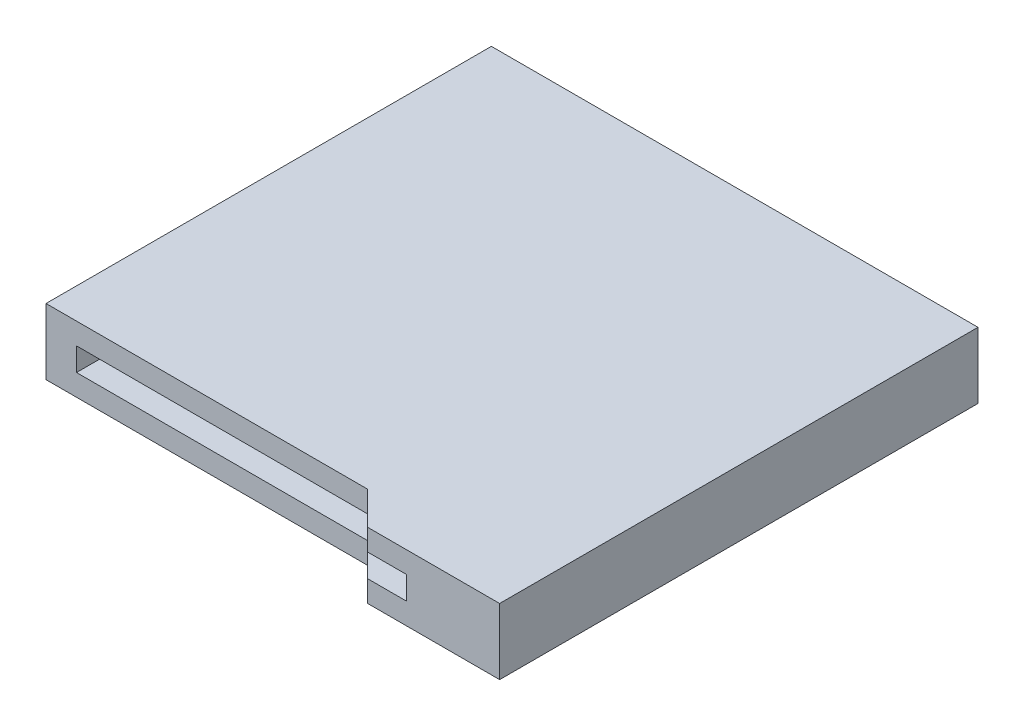
ISO-10303-21;
HEADER;
FILE_DESCRIPTION(('STEP AP214'),'2;1');
FILE_NAME('part.step','',(''),(''),'','','');
FILE_SCHEMA(('AUTOMOTIVE_DESIGN { 1 0 10303 214 1 1 1 1 }'));
ENDSEC;
DATA;
#1=APPLICATION_CONTEXT('core data for automotive mechanical design processes');
#2=APPLICATION_PROTOCOL_DEFINITION('international standard','automotive_design',2000,#1);
#3=PRODUCT_CONTEXT('',#1,'mechanical');
#4=PRODUCT('Part','Part','',(#3));
#5=PRODUCT_RELATED_PRODUCT_CATEGORY('part','',(#4));
#6=PRODUCT_DEFINITION_FORMATION('','',#4);
#7=PRODUCT_DEFINITION_CONTEXT('part definition',#1,'design');
#8=PRODUCT_DEFINITION('design','',#6,#7);
#9=PRODUCT_DEFINITION_SHAPE('','',#8);
#10=(LENGTH_UNIT() NAMED_UNIT(*) SI_UNIT(.MILLI.,.METRE.));
#11=(NAMED_UNIT(*) PLANE_ANGLE_UNIT() SI_UNIT($,.RADIAN.));
#12=(NAMED_UNIT(*) SI_UNIT($,.STERADIAN.) SOLID_ANGLE_UNIT());
#13=UNCERTAINTY_MEASURE_WITH_UNIT(LENGTH_MEASURE(1.E-05),#10,'distance_accuracy_value','');
#14=(GEOMETRIC_REPRESENTATION_CONTEXT(3) GLOBAL_UNCERTAINTY_ASSIGNED_CONTEXT((#13)) GLOBAL_UNIT_ASSIGNED_CONTEXT((#10,
#11,#12)) REPRESENTATION_CONTEXT('',''));
#15=CARTESIAN_POINT('',(0.,0.,0.));
#16=DIRECTION('',(0.,0.,1.));
#17=DIRECTION('',(1.,0.,0.));
#18=AXIS2_PLACEMENT_3D('',#15,#16,#17);
#19=CARTESIAN_POINT('',(2.37499999999999,0.,6.25));
#20=DIRECTION('',(0.707106781186544,0.,-0.707106781186552));
#21=DIRECTION('',(-0.707106781186552,0.,-0.707106781186544));
#22=AXIS2_PLACEMENT_3D('',#19,#20,#21);
#23=PLANE('',#22);
#24=DIRECTION('',(0.,1.,0.));
#25=VECTOR('',#24,1.);
#26=CARTESIAN_POINT('',(3.375,0.,7.25));
#27=LINE('',#26,#25);
#28=CARTESIAN_POINT('',(3.375,0.,7.25));
#29=VERTEX_POINT('',#28);
#30=CARTESIAN_POINT('',(3.375,0.65,7.25));
#31=VERTEX_POINT('',#30);
#32=EDGE_CURVE('E186',#29,#31,#27,.T.);
#33=ORIENTED_EDGE('',*,*,#32,.T.);
#34=DIRECTION('',(-0.707106781186552,0.,-0.707106781186544));
#35=VECTOR('',#34,1.);
#36=CARTESIAN_POINT('',(2.37499999999999,0.65,6.25));
#37=LINE('',#36,#35);
#38=CARTESIAN_POINT('',(2.37499999999999,0.65,6.25));
#39=VERTEX_POINT('',#38);
#40=EDGE_CURVE('E219',#31,#39,#37,.T.);
#41=ORIENTED_EDGE('',*,*,#40,.T.);
#42=DIRECTION('',(0.,1.,0.));
#43=VECTOR('',#42,1.);
#44=CARTESIAN_POINT('',(2.37499999999999,0.,6.25));
#45=LINE('',#44,#43);
#46=CARTESIAN_POINT('',(2.37499999999999,0.,6.25));
#47=VERTEX_POINT('',#46);
#48=EDGE_CURVE('E183',#47,#39,#45,.T.);
#49=ORIENTED_EDGE('',*,*,#48,.F.);
#50=DIRECTION('',(-0.707106781186552,0.,-0.707106781186544));
#51=VECTOR('',#50,1.);
#52=CARTESIAN_POINT('',(2.37499999999999,0.,6.25));
#53=LINE('',#52,#51);
#54=EDGE_CURVE('E170',#29,#47,#53,.T.);
#55=ORIENTED_EDGE('',*,*,#54,.F.);
#56=EDGE_LOOP('',(#33,#41,#49,#55));
#57=FACE_BOUND('',#56,.T.);
#58=ADVANCED_FACE('F33',(#57),#23,.F.);
#59=CARTESIAN_POINT('',(7.375,2.,-7.25));
#60=DIRECTION('',(-1.,0.,0.));
#61=DIRECTION('',(0.,0.,1.));
#62=AXIS2_PLACEMENT_3D('',#59,#60,#61);
#63=PLANE('',#62);
#64=DIRECTION('',(0.,0.,-1.));
#65=VECTOR('',#64,1.);
#66=CARTESIAN_POINT('',(7.375,0.,-7.25));
#67=LINE('',#66,#65);
#68=CARTESIAN_POINT('',(7.375,0.,7.25));
#69=VERTEX_POINT('',#68);
#70=CARTESIAN_POINT('',(7.375,0.,-7.25));
#71=VERTEX_POINT('',#70);
#72=EDGE_CURVE('E182',#69,#71,#67,.T.);
#73=ORIENTED_EDGE('',*,*,#72,.T.);
#74=DIRECTION('',(0.,-1.,0.));
#75=VECTOR('',#74,1.);
#76=CARTESIAN_POINT('',(7.375,2.,-7.25));
#77=LINE('',#76,#75);
#78=CARTESIAN_POINT('',(7.375,2.,-7.25));
#79=VERTEX_POINT('',#78);
#80=EDGE_CURVE('E214',#79,#71,#77,.T.);
#81=ORIENTED_EDGE('',*,*,#80,.F.);
#82=DIRECTION('',(0.,0.,-1.));
#83=VECTOR('',#82,1.);
#84=CARTESIAN_POINT('',(7.375,2.,-7.25));
#85=LINE('',#84,#83);
#86=CARTESIAN_POINT('',(7.375,2.,7.25));
#87=VERTEX_POINT('',#86);
#88=EDGE_CURVE('E189',#87,#79,#85,.T.);
#89=ORIENTED_EDGE('',*,*,#88,.F.);
#90=DIRECTION('',(0.,-1.,0.));
#91=VECTOR('',#90,1.);
#92=CARTESIAN_POINT('',(7.375,2.,7.25));
#93=LINE('',#92,#91);
#94=EDGE_CURVE('E200',#87,#69,#93,.T.);
#95=ORIENTED_EDGE('',*,*,#94,.T.);
#96=EDGE_LOOP('',(#73,#81,#89,#95));
#97=FACE_BOUND('',#96,.T.);
#98=ADVANCED_FACE('F35',(#97),#63,.F.);
#99=CARTESIAN_POINT('',(-7.375,2.,-7.25));
#100=DIRECTION('',(0.,0.,1.));
#101=DIRECTION('',(1.,0.,0.));
#102=AXIS2_PLACEMENT_3D('',#99,#100,#101);
#103=PLANE('',#102);
#104=DIRECTION('',(-1.,0.,0.));
#105=VECTOR('',#104,1.);
#106=CARTESIAN_POINT('',(-7.375,0.,-7.25));
#107=LINE('',#106,#105);
#108=CARTESIAN_POINT('',(-7.375,0.,-7.25));
#109=VERTEX_POINT('',#108);
#110=EDGE_CURVE('E203',#71,#109,#107,.T.);
#111=ORIENTED_EDGE('',*,*,#110,.T.);
#112=DIRECTION('',(0.,-1.,0.));
#113=VECTOR('',#112,1.);
#114=CARTESIAN_POINT('',(-7.375,2.,-7.25));
#115=LINE('',#114,#113);
#116=CARTESIAN_POINT('',(-7.375,2.,-7.25));
#117=VERTEX_POINT('',#116);
#118=EDGE_CURVE('E211',#117,#109,#115,.T.);
#119=ORIENTED_EDGE('',*,*,#118,.F.);
#120=DIRECTION('',(-1.,0.,0.));
#121=VECTOR('',#120,1.);
#122=CARTESIAN_POINT('',(-7.375,2.,-7.25));
#123=LINE('',#122,#121);
#124=EDGE_CURVE('E192',#79,#117,#123,.T.);
#125=ORIENTED_EDGE('',*,*,#124,.F.);
#126=ORIENTED_EDGE('',*,*,#80,.T.);
#127=EDGE_LOOP('',(#111,#119,#125,#126));
#128=FACE_BOUND('',#127,.T.);
#129=ADVANCED_FACE('F265',(#128),#103,.F.);
#130=CARTESIAN_POINT('',(-7.375,2.,-7.25));
#131=DIRECTION('',(1.,0.,0.));
#132=DIRECTION('',(0.,0.,-1.));
#133=AXIS2_PLACEMENT_3D('',#130,#131,#132);
#134=PLANE('',#133);
#135=DIRECTION('',(0.,0.,1.));
#136=VECTOR('',#135,1.);
#137=CARTESIAN_POINT('',(-7.375,0.,-7.25));
#138=LINE('',#137,#136);
#139=CARTESIAN_POINT('',(-7.375,0.,6.25));
#140=VERTEX_POINT('',#139);
#141=EDGE_CURVE('E205',#109,#140,#138,.T.);
#142=ORIENTED_EDGE('',*,*,#141,.T.);
#143=DIRECTION('',(0.,1.,0.));
#144=VECTOR('',#143,1.);
#145=CARTESIAN_POINT('',(-7.375,0.,6.25));
#146=LINE('',#145,#144);
#147=CARTESIAN_POINT('',(-7.375,2.,6.25));
#148=VERTEX_POINT('',#147);
#149=EDGE_CURVE('E179',#140,#148,#146,.T.);
#150=ORIENTED_EDGE('',*,*,#149,.T.);
#151=DIRECTION('',(0.,0.,1.));
#152=VECTOR('',#151,1.);
#153=CARTESIAN_POINT('',(-7.375,2.,-7.25));
#154=LINE('',#153,#152);
#155=EDGE_CURVE('E195',#117,#148,#154,.T.);
#156=ORIENTED_EDGE('',*,*,#155,.F.);
#157=ORIENTED_EDGE('',*,*,#118,.T.);
#158=EDGE_LOOP('',(#142,#150,#156,#157));
#159=FACE_BOUND('',#158,.T.);
#160=ADVANCED_FACE('F275',(#159),#134,.F.);
#161=CARTESIAN_POINT('',(-7.375,2.,7.25));
#162=DIRECTION('',(0.,0.,-1.));
#163=DIRECTION('',(-1.,0.,0.));
#164=AXIS2_PLACEMENT_3D('',#161,#162,#163);
#165=PLANE('',#164);
#166=DIRECTION('',(0.,1.,0.));
#167=VECTOR('',#166,1.);
#168=CARTESIAN_POINT('',(4.55,1.35,7.25));
#169=LINE('',#168,#167);
#170=CARTESIAN_POINT('',(4.55,0.65,7.25));
#171=VERTEX_POINT('',#170);
#172=CARTESIAN_POINT('',(4.55,1.35,7.25));
#173=VERTEX_POINT('',#172);
#174=EDGE_CURVE('E131',#171,#173,#169,.T.);
#175=ORIENTED_EDGE('',*,*,#174,.F.);
#176=DIRECTION('',(1.,0.,0.));
#177=VECTOR('',#176,1.);
#178=CARTESIAN_POINT('',(-6.45,0.65,7.25));
#179=LINE('',#178,#177);
#180=EDGE_CURVE('E146',#31,#171,#179,.T.);
#181=ORIENTED_EDGE('',*,*,#180,.F.);
#182=ORIENTED_EDGE('',*,*,#32,.F.);
#183=DIRECTION('',(1.,0.,0.));
#184=VECTOR('',#183,1.);
#185=CARTESIAN_POINT('',(-7.375,0.,7.25));
#186=LINE('',#185,#184);
#187=EDGE_CURVE('E193',#29,#69,#186,.T.);
#188=ORIENTED_EDGE('',*,*,#187,.T.);
#189=ORIENTED_EDGE('',*,*,#94,.F.);
#190=DIRECTION('',(1.,0.,0.));
#191=VECTOR('',#190,1.);
#192=CARTESIAN_POINT('',(-7.375,2.,7.25));
#193=LINE('',#192,#191);
#194=CARTESIAN_POINT('',(3.375,2.,7.25));
#195=VERTEX_POINT('',#194);
#196=EDGE_CURVE('E198',#195,#87,#193,.T.);
#197=ORIENTED_EDGE('',*,*,#196,.F.);
#198=CARTESIAN_POINT('',(3.375,1.35,7.25));
#199=VERTEX_POINT('',#198);
#200=EDGE_CURVE('E175',#199,#195,#27,.T.);
#201=ORIENTED_EDGE('',*,*,#200,.F.);
#202=DIRECTION('',(-1.,0.,0.));
#203=VECTOR('',#202,1.);
#204=CARTESIAN_POINT('',(-6.45,1.35,7.25));
#205=LINE('',#204,#203);
#206=EDGE_CURVE('E48',#173,#199,#205,.T.);
#207=ORIENTED_EDGE('',*,*,#206,.F.);
#208=EDGE_LOOP('',(#175,#181,#182,#188,#189,#197,#201,#207));
#209=FACE_BOUND('',#208,.T.);
#210=ADVANCED_FACE('F243',(#209),#165,.F.);
#211=CARTESIAN_POINT('',(0.,2.,0.));
#212=DIRECTION('',(0.,1.,0.));
#213=DIRECTION('',(0.,0.,1.));
#214=AXIS2_PLACEMENT_3D('',#211,#212,#213);
#215=PLANE('',#214);
#216=DIRECTION('',(-1.,0.,0.));
#217=VECTOR('',#216,1.);
#218=CARTESIAN_POINT('',(-7.375,2.,6.25));
#219=LINE('',#218,#217);
#220=CARTESIAN_POINT('',(2.37499999999999,2.,6.25));
#221=VERTEX_POINT('',#220);
#222=EDGE_CURVE('E173',#221,#148,#219,.T.);
#223=ORIENTED_EDGE('',*,*,#222,.F.);
#224=DIRECTION('',(-0.707106781186552,0.,-0.707106781186544));
#225=VECTOR('',#224,1.);
#226=CARTESIAN_POINT('',(2.37499999999999,2.,6.25));
#227=LINE('',#226,#225);
#228=EDGE_CURVE('E169',#195,#221,#227,.T.);
#229=ORIENTED_EDGE('',*,*,#228,.F.);
#230=ORIENTED_EDGE('',*,*,#196,.T.);
#231=ORIENTED_EDGE('',*,*,#88,.T.);
#232=ORIENTED_EDGE('',*,*,#124,.T.);
#233=ORIENTED_EDGE('',*,*,#155,.T.);
#234=EDGE_LOOP('',(#223,#229,#230,#231,#232,#233));
#235=FACE_BOUND('',#234,.T.);
#236=ADVANCED_FACE('F233',(#235),#215,.T.);
#237=CARTESIAN_POINT('',(0.,0.,0.));
#238=DIRECTION('',(0.,1.,0.));
#239=DIRECTION('',(0.,0.,1.));
#240=AXIS2_PLACEMENT_3D('',#237,#238,#239);
#241=PLANE('',#240);
#242=CARTESIAN_POINT('',(3.05,0.,3.25));
#243=DIRECTION('',(0.,1.,0.));
#244=DIRECTION('',(0.,0.,1.));
#245=AXIS2_PLACEMENT_3D('',#242,#243,#244);
#246=CIRCLE('',#245,0.4);
#247=CARTESIAN_POINT('',(3.05,0.,3.65));
#248=VERTEX_POINT('',#247);
#249=EDGE_CURVE('E11',#248,#248,#246,.F.);
#250=ORIENTED_EDGE('',*,*,#249,.F.);
#251=EDGE_LOOP('',(#250));
#252=FACE_BOUND('',#251,.T.);
#253=CARTESIAN_POINT('',(-4.95,0.,3.25));
#254=DIRECTION('',(0.,1.,0.));
#255=DIRECTION('',(0.,0.,1.));
#256=AXIS2_PLACEMENT_3D('',#253,#254,#255);
#257=CIRCLE('',#256,0.4);
#258=CARTESIAN_POINT('',(-4.95,0.,3.65));
#259=VERTEX_POINT('',#258);
#260=EDGE_CURVE('E41',#259,#259,#257,.F.);
#261=ORIENTED_EDGE('',*,*,#260,.F.);
#262=EDGE_LOOP('',(#261));
#263=FACE_BOUND('',#262,.T.);
#264=ORIENTED_EDGE('',*,*,#54,.T.);
#265=DIRECTION('',(-1.,0.,0.));
#266=VECTOR('',#265,1.);
#267=CARTESIAN_POINT('',(-7.375,0.,6.25));
#268=LINE('',#267,#266);
#269=EDGE_CURVE('E56',#47,#140,#268,.T.);
#270=ORIENTED_EDGE('',*,*,#269,.T.);
#271=ORIENTED_EDGE('',*,*,#141,.F.);
#272=ORIENTED_EDGE('',*,*,#110,.F.);
#273=ORIENTED_EDGE('',*,*,#72,.F.);
#274=ORIENTED_EDGE('',*,*,#187,.F.);
#275=EDGE_LOOP('',(#264,#270,#271,#272,#273,#274));
#276=FACE_BOUND('',#275,.T.);
#277=ADVANCED_FACE('F229',(#252,#263,#276),#241,.F.);
#278=CARTESIAN_POINT('',(-7.375,0.,6.25));
#279=DIRECTION('',(0.,0.,-1.));
#280=DIRECTION('',(-1.,0.,0.));
#281=AXIS2_PLACEMENT_3D('',#278,#279,#280);
#282=PLANE('',#281);
#283=ORIENTED_EDGE('',*,*,#48,.T.);
#284=DIRECTION('',(-1.,0.,0.));
#285=VECTOR('',#284,1.);
#286=CARTESIAN_POINT('',(-7.375,0.65,6.25));
#287=LINE('',#286,#285);
#288=CARTESIAN_POINT('',(-6.45,0.65,6.25));
#289=VERTEX_POINT('',#288);
#290=EDGE_CURVE('E166',#39,#289,#287,.T.);
#291=ORIENTED_EDGE('',*,*,#290,.T.);
#292=DIRECTION('',(0.,1.,0.));
#293=VECTOR('',#292,1.);
#294=CARTESIAN_POINT('',(-6.45,0.,6.25));
#295=LINE('',#294,#293);
#296=CARTESIAN_POINT('',(-6.45,1.35,6.25));
#297=VERTEX_POINT('',#296);
#298=EDGE_CURVE('E222',#289,#297,#295,.T.);
#299=ORIENTED_EDGE('',*,*,#298,.T.);
#300=DIRECTION('',(1.,0.,0.));
#301=VECTOR('',#300,1.);
#302=CARTESIAN_POINT('',(-7.375,1.35,6.25));
#303=LINE('',#302,#301);
#304=CARTESIAN_POINT('',(2.37499999999999,1.35,6.25));
#305=VERTEX_POINT('',#304);
#306=EDGE_CURVE('E159',#297,#305,#303,.T.);
#307=ORIENTED_EDGE('',*,*,#306,.T.);
#308=EDGE_CURVE('E185',#305,#221,#45,.T.);
#309=ORIENTED_EDGE('',*,*,#308,.T.);
#310=ORIENTED_EDGE('',*,*,#222,.T.);
#311=ORIENTED_EDGE('',*,*,#149,.F.);
#312=ORIENTED_EDGE('',*,*,#269,.F.);
#313=EDGE_LOOP('',(#283,#291,#299,#307,#309,#310,#311,#312));
#314=FACE_BOUND('',#313,.T.);
#315=ADVANCED_FACE('F232',(#314),#282,.F.);
#316=ORIENTED_EDGE('',*,*,#308,.F.);
#317=DIRECTION('',(0.707106781186552,0.,0.707106781186544));
#318=VECTOR('',#317,1.);
#319=CARTESIAN_POINT('',(2.37499999999999,1.35,6.25));
#320=LINE('',#319,#318);
#321=EDGE_CURVE('E217',#305,#199,#320,.T.);
#322=ORIENTED_EDGE('',*,*,#321,.T.);
#323=ORIENTED_EDGE('',*,*,#200,.T.);
#324=ORIENTED_EDGE('',*,*,#228,.T.);
#325=EDGE_LOOP('',(#316,#322,#323,#324));
#326=FACE_BOUND('',#325,.T.);
#327=ADVANCED_FACE('F251',(#326),#23,.F.);
#328=CARTESIAN_POINT('',(-6.45,1.35,-4.75));
#329=DIRECTION('',(-1.,0.,0.));
#330=DIRECTION('',(0.,0.,1.));
#331=AXIS2_PLACEMENT_3D('',#328,#329,#330);
#332=PLANE('',#331);
#333=DIRECTION('',(0.,0.,1.));
#334=VECTOR('',#333,1.);
#335=CARTESIAN_POINT('',(-6.45,0.65,-4.75));
#336=LINE('',#335,#334);
#337=CARTESIAN_POINT('',(-6.45,0.65,-4.75));
#338=VERTEX_POINT('',#337);
#339=EDGE_CURVE('E160',#338,#289,#336,.T.);
#340=ORIENTED_EDGE('',*,*,#339,.F.);
#341=DIRECTION('',(0.,-1.,0.));
#342=VECTOR('',#341,1.);
#343=CARTESIAN_POINT('',(-6.45,1.35,-4.75));
#344=LINE('',#343,#342);
#345=CARTESIAN_POINT('',(-6.45,1.35,-4.75));
#346=VERTEX_POINT('',#345);
#347=EDGE_CURVE('E142',#346,#338,#344,.T.);
#348=ORIENTED_EDGE('',*,*,#347,.F.);
#349=DIRECTION('',(0.,0.,1.));
#350=VECTOR('',#349,1.);
#351=CARTESIAN_POINT('',(-6.45,1.35,-4.75));
#352=LINE('',#351,#350);
#353=EDGE_CURVE('E132',#346,#297,#352,.T.);
#354=ORIENTED_EDGE('',*,*,#353,.T.);
#355=ORIENTED_EDGE('',*,*,#298,.F.);
#356=EDGE_LOOP('',(#340,#348,#354,#355));
#357=FACE_BOUND('',#356,.T.);
#358=ADVANCED_FACE('F249',(#357),#332,.F.);
#359=CARTESIAN_POINT('',(-6.45,0.65,-4.75));
#360=DIRECTION('',(0.,-1.,0.));
#361=DIRECTION('',(0.,0.,-1.));
#362=AXIS2_PLACEMENT_3D('',#359,#360,#361);
#363=PLANE('',#362);
#364=ORIENTED_EDGE('',*,*,#40,.F.);
#365=ORIENTED_EDGE('',*,*,#180,.T.);
#366=DIRECTION('',(0.,0.,1.));
#367=VECTOR('',#366,1.);
#368=CARTESIAN_POINT('',(4.55,0.65,-4.75));
#369=LINE('',#368,#367);
#370=CARTESIAN_POINT('',(4.55,0.65,-4.75));
#371=VERTEX_POINT('',#370);
#372=EDGE_CURVE('E157',#371,#171,#369,.T.);
#373=ORIENTED_EDGE('',*,*,#372,.F.);
#374=DIRECTION('',(1.,0.,0.));
#375=VECTOR('',#374,1.);
#376=CARTESIAN_POINT('',(-6.45,0.65,-4.75));
#377=LINE('',#376,#375);
#378=EDGE_CURVE('E133',#338,#371,#377,.T.);
#379=ORIENTED_EDGE('',*,*,#378,.F.);
#380=ORIENTED_EDGE('',*,*,#339,.T.);
#381=ORIENTED_EDGE('',*,*,#290,.F.);
#382=EDGE_LOOP('',(#364,#365,#373,#379,#380,#381));
#383=FACE_BOUND('',#382,.T.);
#384=ADVANCED_FACE('F246',(#383),#363,.F.);
#385=CARTESIAN_POINT('',(-6.45,1.35,-4.75));
#386=DIRECTION('',(0.,1.,0.));
#387=DIRECTION('',(0.,0.,1.));
#388=AXIS2_PLACEMENT_3D('',#385,#386,#387);
#389=PLANE('',#388);
#390=ORIENTED_EDGE('',*,*,#353,.F.);
#391=DIRECTION('',(-1.,0.,0.));
#392=VECTOR('',#391,1.);
#393=CARTESIAN_POINT('',(-6.45,1.35,-4.75));
#394=LINE('',#393,#392);
#395=CARTESIAN_POINT('',(4.55,1.35,-4.75));
#396=VERTEX_POINT('',#395);
#397=EDGE_CURVE('E136',#396,#346,#394,.T.);
#398=ORIENTED_EDGE('',*,*,#397,.F.);
#399=DIRECTION('',(0.,0.,1.));
#400=VECTOR('',#399,1.);
#401=CARTESIAN_POINT('',(4.55,1.35,-4.75));
#402=LINE('',#401,#400);
#403=EDGE_CURVE('E123',#396,#173,#402,.T.);
#404=ORIENTED_EDGE('',*,*,#403,.T.);
#405=ORIENTED_EDGE('',*,*,#206,.T.);
#406=ORIENTED_EDGE('',*,*,#321,.F.);
#407=ORIENTED_EDGE('',*,*,#306,.F.);
#408=EDGE_LOOP('',(#390,#398,#404,#405,#406,#407));
#409=FACE_BOUND('',#408,.T.);
#410=ADVANCED_FACE('F137',(#409),#389,.F.);
#411=CARTESIAN_POINT('',(4.55,1.35,-4.75));
#412=DIRECTION('',(1.,0.,0.));
#413=DIRECTION('',(0.,0.,-1.));
#414=AXIS2_PLACEMENT_3D('',#411,#412,#413);
#415=PLANE('',#414);
#416=ORIENTED_EDGE('',*,*,#174,.T.);
#417=ORIENTED_EDGE('',*,*,#403,.F.);
#418=DIRECTION('',(0.,1.,0.));
#419=VECTOR('',#418,1.);
#420=CARTESIAN_POINT('',(4.55,1.35,-4.75));
#421=LINE('',#420,#419);
#422=EDGE_CURVE('E128',#371,#396,#421,.T.);
#423=ORIENTED_EDGE('',*,*,#422,.F.);
#424=ORIENTED_EDGE('',*,*,#372,.T.);
#425=EDGE_LOOP('',(#416,#417,#423,#424));
#426=FACE_BOUND('',#425,.T.);
#427=ADVANCED_FACE('F125',(#426),#415,.F.);
#428=CARTESIAN_POINT('',(0.,0.,-4.75));
#429=DIRECTION('',(0.,0.,1.));
#430=DIRECTION('',(1.,0.,0.));
#431=AXIS2_PLACEMENT_3D('',#428,#429,#430);
#432=PLANE('',#431);
#433=ORIENTED_EDGE('',*,*,#422,.T.);
#434=ORIENTED_EDGE('',*,*,#397,.T.);
#435=ORIENTED_EDGE('',*,*,#347,.T.);
#436=ORIENTED_EDGE('',*,*,#378,.T.);
#437=EDGE_LOOP('',(#433,#434,#435,#436));
#438=FACE_BOUND('',#437,.T.);
#439=ADVANCED_FACE('F144',(#438),#432,.T.);
#440=CARTESIAN_POINT('',(-4.95,-0.65,3.25));
#441=DIRECTION('',(0.,1.,0.));
#442=DIRECTION('',(0.,0.,1.));
#443=AXIS2_PLACEMENT_3D('',#440,#441,#442);
#444=CYLINDRICAL_SURFACE('',#443,0.4);
#445=CARTESIAN_POINT('',(-4.95,-0.65,3.25));
#446=DIRECTION('',(0.,-1.,0.));
#447=DIRECTION('',(0.,0.,-1.));
#448=AXIS2_PLACEMENT_3D('',#445,#446,#447);
#449=CIRCLE('',#448,0.4);
#450=CARTESIAN_POINT('',(-4.95,-0.65,2.85));
#451=VERTEX_POINT('',#450);
#452=EDGE_CURVE('E150',#451,#451,#449,.T.);
#453=ORIENTED_EDGE('',*,*,#452,.F.);
#454=EDGE_LOOP('',(#453));
#455=FACE_BOUND('',#454,.T.);
#456=ORIENTED_EDGE('',*,*,#260,.T.);
#457=EDGE_LOOP('',(#456));
#458=FACE_BOUND('',#457,.T.);
#459=ADVANCED_FACE('F227',(#455,#458),#444,.T.);
#460=CARTESIAN_POINT('',(-4.95,-0.65,3.25));
#461=DIRECTION('',(0.,-1.,0.));
#462=DIRECTION('',(0.,0.,-1.));
#463=AXIS2_PLACEMENT_3D('',#460,#461,#462);
#464=PLANE('',#463);
#465=ORIENTED_EDGE('',*,*,#452,.T.);
#466=EDGE_LOOP('',(#465));
#467=FACE_BOUND('',#466,.T.);
#468=ADVANCED_FACE('F361',(#467),#464,.T.);
#469=CARTESIAN_POINT('',(3.05,-0.65,3.25));
#470=DIRECTION('',(0.,1.,0.));
#471=DIRECTION('',(0.,0.,1.));
#472=AXIS2_PLACEMENT_3D('',#469,#470,#471);
#473=CYLINDRICAL_SURFACE('',#472,0.4);
#474=CARTESIAN_POINT('',(3.05,-0.65,3.25));
#475=DIRECTION('',(0.,-1.,0.));
#476=DIRECTION('',(0.,0.,-1.));
#477=AXIS2_PLACEMENT_3D('',#474,#475,#476);
#478=CIRCLE('',#477,0.4);
#479=CARTESIAN_POINT('',(3.05,-0.65,2.85));
#480=VERTEX_POINT('',#479);
#481=EDGE_CURVE('E397',#480,#480,#478,.T.);
#482=ORIENTED_EDGE('',*,*,#481,.F.);
#483=EDGE_LOOP('',(#482));
#484=FACE_BOUND('',#483,.T.);
#485=ORIENTED_EDGE('',*,*,#249,.T.);
#486=EDGE_LOOP('',(#485));
#487=FACE_BOUND('',#486,.T.);
#488=ADVANCED_FACE('F368',(#484,#487),#473,.T.);
#489=CARTESIAN_POINT('',(3.05,-0.65,3.25));
#490=DIRECTION('',(0.,-1.,0.));
#491=DIRECTION('',(0.,0.,-1.));
#492=AXIS2_PLACEMENT_3D('',#489,#490,#491);
#493=PLANE('',#492);
#494=ORIENTED_EDGE('',*,*,#481,.T.);
#495=EDGE_LOOP('',(#494));
#496=FACE_BOUND('',#495,.T.);
#497=ADVANCED_FACE('F376',(#496),#493,.T.);
#498=CLOSED_SHELL('',(#58,#98,#129,#160,#210,#236,#277,#315,#327,#358,#384,#410,#427,#439,#459,
#468,#488,#497));
#499=MANIFOLD_SOLID_BREP('B2',#498);
#500=ADVANCED_BREP_SHAPE_REPRESENTATION('',(#18,#499),#14);
#501=SHAPE_DEFINITION_REPRESENTATION(#9,#500);
ENDSEC;
END-ISO-10303-21;
